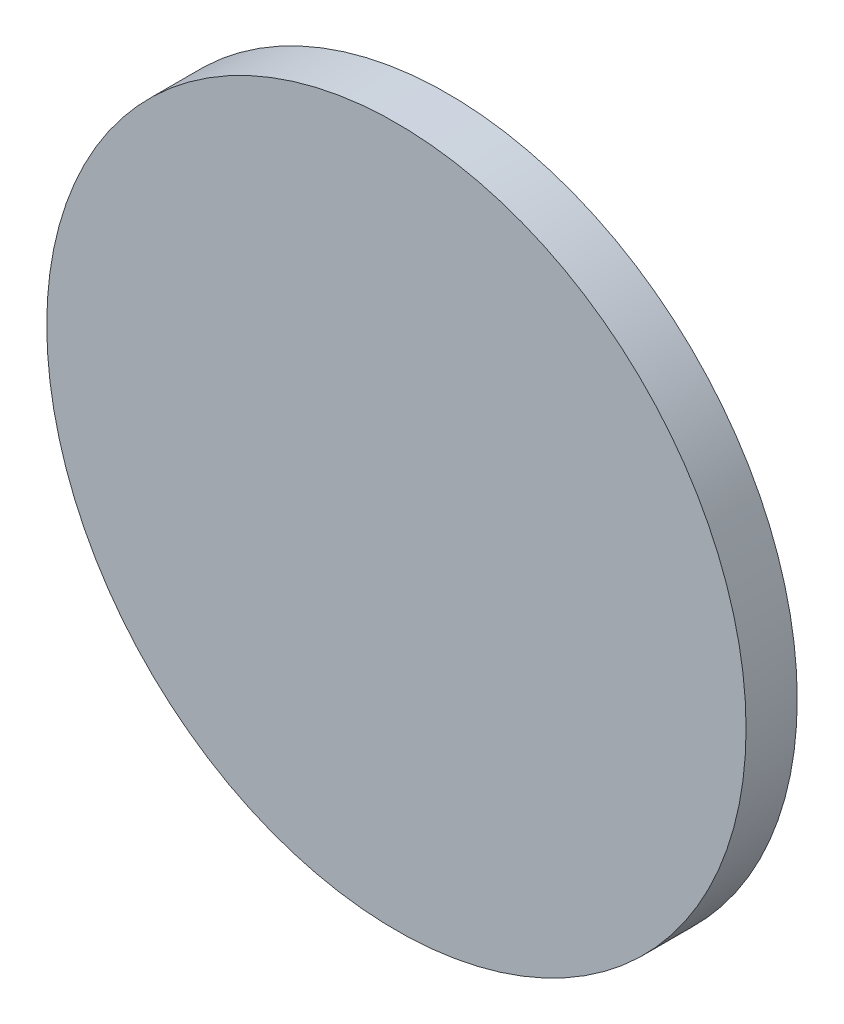
ISO-10303-21;
HEADER;
FILE_DESCRIPTION(('STEP AP214'),'2;1');
FILE_NAME('part.step','',(''),(''),'','','');
FILE_SCHEMA(('AUTOMOTIVE_DESIGN { 1 0 10303 214 1 1 1 1 }'));
ENDSEC;
DATA;
#1=APPLICATION_CONTEXT('core data for automotive mechanical design processes');
#2=APPLICATION_PROTOCOL_DEFINITION('international standard','automotive_design',2000,#1);
#3=PRODUCT_CONTEXT('',#1,'mechanical');
#4=PRODUCT('Part','Part','',(#3));
#5=PRODUCT_RELATED_PRODUCT_CATEGORY('part','',(#4));
#6=PRODUCT_DEFINITION_FORMATION('','',#4);
#7=PRODUCT_DEFINITION_CONTEXT('part definition',#1,'design');
#8=PRODUCT_DEFINITION('design','',#6,#7);
#9=PRODUCT_DEFINITION_SHAPE('','',#8);
#10=(LENGTH_UNIT() NAMED_UNIT(*) SI_UNIT(.MILLI.,.METRE.));
#11=(NAMED_UNIT(*) PLANE_ANGLE_UNIT() SI_UNIT($,.RADIAN.));
#12=(NAMED_UNIT(*) SI_UNIT($,.STERADIAN.) SOLID_ANGLE_UNIT());
#13=UNCERTAINTY_MEASURE_WITH_UNIT(LENGTH_MEASURE(1.E-05),#10,'distance_accuracy_value','');
#14=(GEOMETRIC_REPRESENTATION_CONTEXT(3) GLOBAL_UNCERTAINTY_ASSIGNED_CONTEXT((#13)) GLOBAL_UNIT_ASSIGNED_CONTEXT((#10,
#11,#12)) REPRESENTATION_CONTEXT('',''));
#15=CARTESIAN_POINT('',(0.,0.,0.));
#16=DIRECTION('',(0.,0.,1.));
#17=DIRECTION('',(1.,0.,0.));
#18=AXIS2_PLACEMENT_3D('',#15,#16,#17);
#19=CARTESIAN_POINT('',(0.,0.,0.1499997));
#20=DIRECTION('',(0.,0.,1.));
#21=DIRECTION('',(1.,0.,0.));
#22=AXIS2_PLACEMENT_3D('',#19,#20,#21);
#23=PLANE('',#22);
#24=CARTESIAN_POINT('',(0.,0.,0.1499997));
#25=DIRECTION('',(0.,0.,1.));
#26=DIRECTION('',(1.,0.,0.));
#27=AXIS2_PLACEMENT_3D('',#24,#25,#26);
#28=CIRCLE('',#27,1.02499922);
#29=CARTESIAN_POINT('',(-1.02499922,0.,0.1499997));
#30=VERTEX_POINT('',#29);
#31=EDGE_CURVE('E11',#30,#30,#28,.T.);
#32=ORIENTED_EDGE('',*,*,#31,.T.);
#33=EDGE_LOOP('',(#32));
#34=FACE_BOUND('',#33,.T.);
#35=ADVANCED_FACE('F16',(#34),#23,.T.);
#36=CARTESIAN_POINT('',(0.,0.,0.));
#37=DIRECTION('',(0.,0.,1.));
#38=DIRECTION('',(1.,0.,0.));
#39=AXIS2_PLACEMENT_3D('',#36,#37,#38);
#40=PLANE('',#39);
#41=CARTESIAN_POINT('',(0.,0.,0.));
#42=DIRECTION('',(0.,0.,1.));
#43=DIRECTION('',(1.,0.,0.));
#44=AXIS2_PLACEMENT_3D('',#41,#42,#43);
#45=CIRCLE('',#44,1.02499922);
#46=CARTESIAN_POINT('',(-1.02499922,0.,0.));
#47=VERTEX_POINT('',#46);
#48=EDGE_CURVE('E19',#47,#47,#45,.T.);
#49=ORIENTED_EDGE('',*,*,#48,.F.);
#50=EDGE_LOOP('',(#49));
#51=FACE_BOUND('',#50,.T.);
#52=ADVANCED_FACE('F61',(#51),#40,.F.);
#53=CARTESIAN_POINT('',(0.,0.,0.));
#54=DIRECTION('',(0.,0.,-1.));
#55=DIRECTION('',(1.,0.,0.));
#56=AXIS2_PLACEMENT_3D('',#53,#54,#55);
#57=CYLINDRICAL_SURFACE('',#56,1.02499922);
#58=ORIENTED_EDGE('',*,*,#48,.T.);
#59=DIRECTION('',(0.,0.,1.));
#60=VECTOR('',#59,1.);
#61=CARTESIAN_POINT('',(-1.02499922,0.,0.));
#62=LINE('',#61,#60);
#63=EDGE_CURVE('E25',#47,#30,#62,.T.);
#64=ORIENTED_EDGE('',*,*,#63,.T.);
#65=ORIENTED_EDGE('',*,*,#31,.F.);
#66=ORIENTED_EDGE('',*,*,#63,.F.);
#67=EDGE_LOOP('',(#58,#64,#65,#66));
#68=FACE_BOUND('',#67,.T.);
#69=ADVANCED_FACE('F40',(#68),#57,.T.);
#70=CLOSED_SHELL('',(#35,#52,#69));
#71=MANIFOLD_SOLID_BREP('B1',#70);
#72=ADVANCED_BREP_SHAPE_REPRESENTATION('',(#18,#71),#14);
#73=SHAPE_DEFINITION_REPRESENTATION(#9,#72);
ENDSEC;
END-ISO-10303-21;
